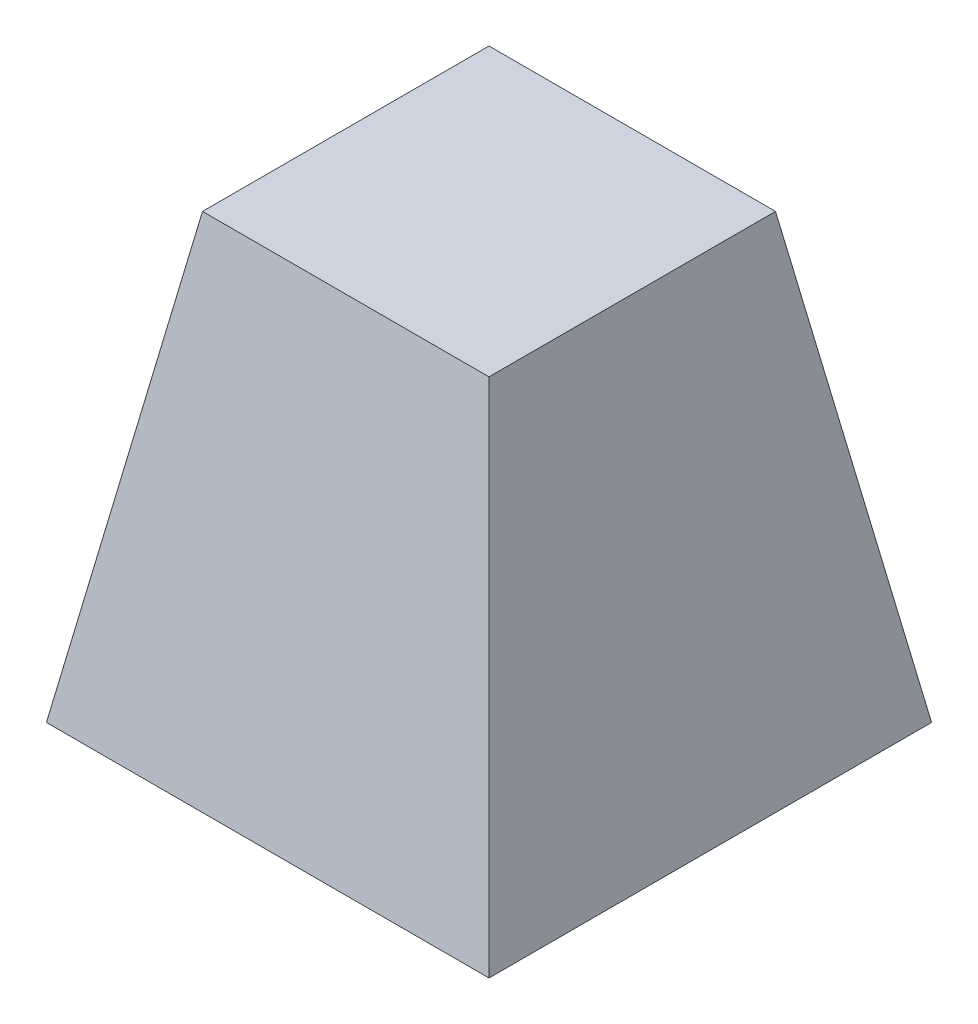
ISO-10303-21;
HEADER;
FILE_DESCRIPTION(('STEP AP214'),'2;1');
FILE_NAME('part.step','',(''),(''),'','','');
FILE_SCHEMA(('AUTOMOTIVE_DESIGN { 1 0 10303 214 1 1 1 1 }'));
ENDSEC;
DATA;
#1=APPLICATION_CONTEXT('core data for automotive mechanical design processes');
#2=APPLICATION_PROTOCOL_DEFINITION('international standard','automotive_design',2000,#1);
#3=PRODUCT_CONTEXT('',#1,'mechanical');
#4=PRODUCT('Part','Part','',(#3));
#5=PRODUCT_RELATED_PRODUCT_CATEGORY('part','',(#4));
#6=PRODUCT_DEFINITION_FORMATION('','',#4);
#7=PRODUCT_DEFINITION_CONTEXT('part definition',#1,'design');
#8=PRODUCT_DEFINITION('design','',#6,#7);
#9=PRODUCT_DEFINITION_SHAPE('','',#8);
#10=(LENGTH_UNIT() NAMED_UNIT(*) SI_UNIT(.MILLI.,.METRE.));
#11=(NAMED_UNIT(*) PLANE_ANGLE_UNIT() SI_UNIT($,.RADIAN.));
#12=(NAMED_UNIT(*) SI_UNIT($,.STERADIAN.) SOLID_ANGLE_UNIT());
#13=UNCERTAINTY_MEASURE_WITH_UNIT(LENGTH_MEASURE(1.E-05),#10,'distance_accuracy_value','');
#14=(GEOMETRIC_REPRESENTATION_CONTEXT(3) GLOBAL_UNCERTAINTY_ASSIGNED_CONTEXT((#13)) GLOBAL_UNIT_ASSIGNED_CONTEXT((#10,
#11,#12)) REPRESENTATION_CONTEXT('',''));
#15=CARTESIAN_POINT('',(0.,0.,0.));
#16=DIRECTION('',(0.,0.,1.));
#17=DIRECTION('',(1.,0.,0.));
#18=AXIS2_PLACEMENT_3D('',#15,#16,#17);
#19=CARTESIAN_POINT('',(-12.7,0.,12.7));
#20=DIRECTION('',(-0.984807753012208,0.173648177666931,0.));
#21=DIRECTION('',(-0.173648177666931,-0.984807753012208,0.));
#22=AXIS2_PLACEMENT_3D('',#19,#20,#21);
#23=PLANE('',#22);
#24=DIRECTION('',(0.,0.,1.));
#25=VECTOR('',#24,1.);
#26=CARTESIAN_POINT('',(-12.7,0.,12.7));
#27=LINE('',#26,#25);
#28=CARTESIAN_POINT('',(-12.7,0.,-12.7));
#29=VERTEX_POINT('',#28);
#30=CARTESIAN_POINT('',(-12.7,0.,12.7));
#31=VERTEX_POINT('',#30);
#32=EDGE_CURVE('E79',#29,#31,#27,.T.);
#33=ORIENTED_EDGE('',*,*,#32,.T.);
#34=DIRECTION('',(-0.171087869746036,-0.970287525247814,0.171087869746036));
#35=VECTOR('',#34,1.);
#36=CARTESIAN_POINT('',(-11.9565150969744,4.21651241368936,11.9565150969744));
#37=LINE('',#36,#35);
#38=CARTESIAN_POINT('',(-8.22129469000499,25.4,8.22129469000498));
#39=VERTEX_POINT('',#38);
#40=EDGE_CURVE('E11',#39,#31,#37,.T.);
#41=ORIENTED_EDGE('',*,*,#40,.F.);
#42=DIRECTION('',(0.,0.,-1.));
#43=VECTOR('',#42,1.);
#44=CARTESIAN_POINT('',(-8.22129469000499,25.4,12.7));
#45=LINE('',#44,#43);
#46=CARTESIAN_POINT('',(-8.22129469000499,25.4,-8.22129469000498));
#47=VERTEX_POINT('',#46);
#48=EDGE_CURVE('E95',#47,#39,#45,.F.);
#49=ORIENTED_EDGE('',*,*,#48,.F.);
#50=DIRECTION('',(-0.171087869746036,-0.970287525247814,-0.171087869746036));
#51=VECTOR('',#50,1.);
#52=CARTESIAN_POINT('',(-11.9565150969744,4.21651241368936,-11.9565150969744));
#53=LINE('',#52,#51);
#54=EDGE_CURVE('E90',#47,#29,#53,.T.);
#55=ORIENTED_EDGE('',*,*,#54,.T.);
#56=EDGE_LOOP('',(#33,#41,#49,#55));
#57=FACE_BOUND('',#56,.T.);
#58=ADVANCED_FACE('F33',(#57),#23,.T.);
#59=CARTESIAN_POINT('',(12.7,0.,12.7));
#60=DIRECTION('',(0.,0.173648177666931,0.984807753012208));
#61=DIRECTION('',(0.,-0.984807753012208,0.173648177666931));
#62=AXIS2_PLACEMENT_3D('',#59,#60,#61);
#63=PLANE('',#62);
#64=DIRECTION('',(1.,0.,0.));
#65=VECTOR('',#64,1.);
#66=CARTESIAN_POINT('',(12.7,0.,12.7));
#67=LINE('',#66,#65);
#68=CARTESIAN_POINT('',(12.7,0.,12.7));
#69=VERTEX_POINT('',#68);
#70=EDGE_CURVE('E75',#31,#69,#67,.T.);
#71=ORIENTED_EDGE('',*,*,#70,.T.);
#72=DIRECTION('',(0.171087869746036,-0.970287525247814,0.171087869746036));
#73=VECTOR('',#72,1.);
#74=CARTESIAN_POINT('',(12.7,0.,12.7));
#75=LINE('',#74,#73);
#76=CARTESIAN_POINT('',(8.22129469000498,25.4,8.22129469000498));
#77=VERTEX_POINT('',#76);
#78=EDGE_CURVE('E42',#77,#69,#75,.T.);
#79=ORIENTED_EDGE('',*,*,#78,.F.);
#80=DIRECTION('',(-1.,0.,0.));
#81=VECTOR('',#80,1.);
#82=CARTESIAN_POINT('',(12.7,25.4,8.22129469000497));
#83=LINE('',#82,#81);
#84=EDGE_CURVE('E86',#39,#77,#83,.F.);
#85=ORIENTED_EDGE('',*,*,#84,.F.);
#86=ORIENTED_EDGE('',*,*,#40,.T.);
#87=EDGE_LOOP('',(#71,#79,#85,#86));
#88=FACE_BOUND('',#87,.T.);
#89=ADVANCED_FACE('F35',(#88),#63,.T.);
#90=CARTESIAN_POINT('',(12.7,0.,12.7));
#91=DIRECTION('',(0.984807753012208,0.173648177666931,0.));
#92=DIRECTION('',(-0.173648177666931,0.984807753012208,0.));
#93=AXIS2_PLACEMENT_3D('',#90,#91,#92);
#94=PLANE('',#93);
#95=DIRECTION('',(0.,0.,-1.));
#96=VECTOR('',#95,1.);
#97=CARTESIAN_POINT('',(12.7,0.,12.7));
#98=LINE('',#97,#96);
#99=CARTESIAN_POINT('',(12.7,0.,-12.7));
#100=VERTEX_POINT('',#99);
#101=EDGE_CURVE('E80',#69,#100,#98,.T.);
#102=ORIENTED_EDGE('',*,*,#101,.T.);
#103=DIRECTION('',(0.171087869746036,-0.970287525247814,-0.171087869746036));
#104=VECTOR('',#103,1.);
#105=CARTESIAN_POINT('',(12.7,0.,-12.7));
#106=LINE('',#105,#104);
#107=CARTESIAN_POINT('',(8.22129469000498,25.4,-8.22129469000499));
#108=VERTEX_POINT('',#107);
#109=EDGE_CURVE('E98',#108,#100,#106,.T.);
#110=ORIENTED_EDGE('',*,*,#109,.F.);
#111=DIRECTION('',(0.,0.,1.));
#112=VECTOR('',#111,1.);
#113=CARTESIAN_POINT('',(8.22129469000498,25.4,12.7));
#114=LINE('',#113,#112);
#115=EDGE_CURVE('E54',#77,#108,#114,.F.);
#116=ORIENTED_EDGE('',*,*,#115,.F.);
#117=ORIENTED_EDGE('',*,*,#78,.T.);
#118=EDGE_LOOP('',(#102,#110,#116,#117));
#119=FACE_BOUND('',#118,.T.);
#120=ADVANCED_FACE('F105',(#119),#94,.T.);
#121=CARTESIAN_POINT('',(12.7,0.,-12.7));
#122=DIRECTION('',(0.,0.173648177666931,-0.984807753012208));
#123=DIRECTION('',(0.,0.984807753012208,0.173648177666931));
#124=AXIS2_PLACEMENT_3D('',#121,#122,#123);
#125=PLANE('',#124);
#126=DIRECTION('',(-1.,0.,0.));
#127=VECTOR('',#126,1.);
#128=CARTESIAN_POINT('',(12.7,0.,-12.7));
#129=LINE('',#128,#127);
#130=EDGE_CURVE('E94',#100,#29,#129,.T.);
#131=ORIENTED_EDGE('',*,*,#130,.T.);
#132=ORIENTED_EDGE('',*,*,#54,.F.);
#133=DIRECTION('',(1.,0.,0.));
#134=VECTOR('',#133,1.);
#135=CARTESIAN_POINT('',(12.7,25.4,-8.22129469000499));
#136=LINE('',#135,#134);
#137=EDGE_CURVE('E37',#108,#47,#136,.F.);
#138=ORIENTED_EDGE('',*,*,#137,.F.);
#139=ORIENTED_EDGE('',*,*,#109,.T.);
#140=EDGE_LOOP('',(#131,#132,#138,#139));
#141=FACE_BOUND('',#140,.T.);
#142=ADVANCED_FACE('F107',(#141),#125,.T.);
#143=CARTESIAN_POINT('',(0.,25.4,0.));
#144=DIRECTION('',(0.,1.,0.));
#145=DIRECTION('',(0.,0.,1.));
#146=AXIS2_PLACEMENT_3D('',#143,#144,#145);
#147=PLANE('',#146);
#148=ORIENTED_EDGE('',*,*,#48,.T.);
#149=ORIENTED_EDGE('',*,*,#84,.T.);
#150=ORIENTED_EDGE('',*,*,#115,.T.);
#151=ORIENTED_EDGE('',*,*,#137,.T.);
#152=EDGE_LOOP('',(#148,#149,#150,#151));
#153=FACE_BOUND('',#152,.T.);
#154=ADVANCED_FACE('F103',(#153),#147,.T.);
#155=CARTESIAN_POINT('',(0.,0.,0.));
#156=DIRECTION('',(0.,1.,0.));
#157=DIRECTION('',(0.,0.,1.));
#158=AXIS2_PLACEMENT_3D('',#155,#156,#157);
#159=PLANE('',#158);
#160=ORIENTED_EDGE('',*,*,#32,.F.);
#161=ORIENTED_EDGE('',*,*,#130,.F.);
#162=ORIENTED_EDGE('',*,*,#101,.F.);
#163=ORIENTED_EDGE('',*,*,#70,.F.);
#164=EDGE_LOOP('',(#160,#161,#162,#163));
#165=FACE_BOUND('',#164,.T.);
#166=ADVANCED_FACE('F76',(#165),#159,.F.);
#167=CLOSED_SHELL('',(#58,#89,#120,#142,#154,#166));
#168=MANIFOLD_SOLID_BREP('B2',#167);
#169=ADVANCED_BREP_SHAPE_REPRESENTATION('',(#18,#168),#14);
#170=SHAPE_DEFINITION_REPRESENTATION(#9,#169);
ENDSEC;
END-ISO-10303-21;
